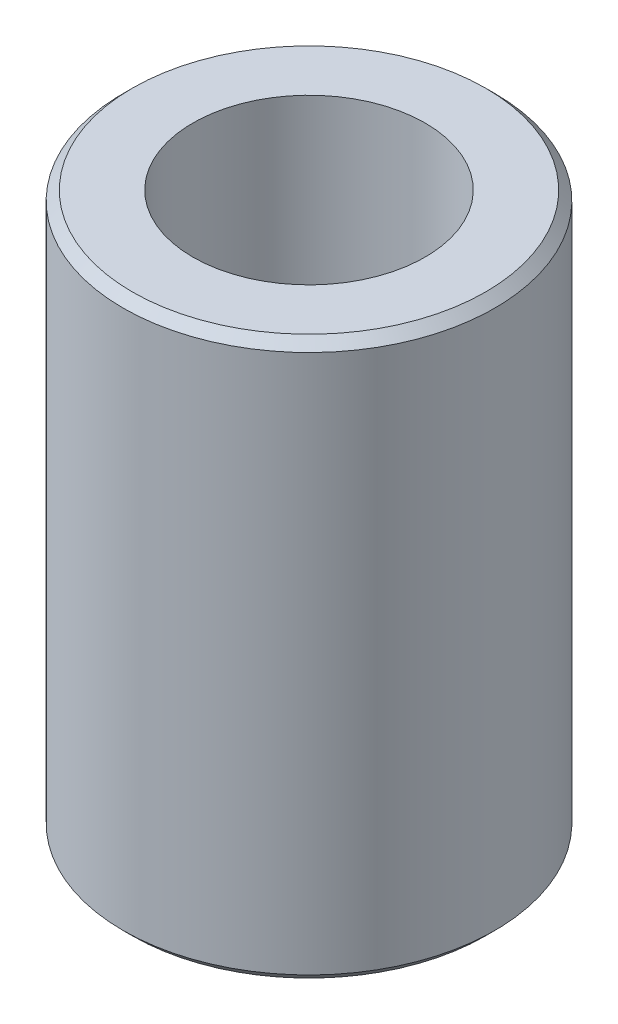
ISO-10303-21;
HEADER;
FILE_DESCRIPTION(('STEP AP214'),'2;1');
FILE_NAME('part.step','',(''),(''),'','','');
FILE_SCHEMA(('AUTOMOTIVE_DESIGN { 1 0 10303 214 1 1 1 1 }'));
ENDSEC;
DATA;
#1=APPLICATION_CONTEXT('core data for automotive mechanical design processes');
#2=APPLICATION_PROTOCOL_DEFINITION('international standard','automotive_design',2000,#1);
#3=PRODUCT_CONTEXT('',#1,'mechanical');
#4=PRODUCT('Part','Part','',(#3));
#5=PRODUCT_RELATED_PRODUCT_CATEGORY('part','',(#4));
#6=PRODUCT_DEFINITION_FORMATION('','',#4);
#7=PRODUCT_DEFINITION_CONTEXT('part definition',#1,'design');
#8=PRODUCT_DEFINITION('design','',#6,#7);
#9=PRODUCT_DEFINITION_SHAPE('','',#8);
#10=(LENGTH_UNIT() NAMED_UNIT(*) SI_UNIT(.MILLI.,.METRE.));
#11=(NAMED_UNIT(*) PLANE_ANGLE_UNIT() SI_UNIT($,.RADIAN.));
#12=(NAMED_UNIT(*) SI_UNIT($,.STERADIAN.) SOLID_ANGLE_UNIT());
#13=UNCERTAINTY_MEASURE_WITH_UNIT(LENGTH_MEASURE(1.E-05),#10,'distance_accuracy_value','');
#14=(GEOMETRIC_REPRESENTATION_CONTEXT(3) GLOBAL_UNCERTAINTY_ASSIGNED_CONTEXT((#13)) GLOBAL_UNIT_ASSIGNED_CONTEXT((#10,
#11,#12)) REPRESENTATION_CONTEXT('',''));
#15=CARTESIAN_POINT('',(0.,0.,0.));
#16=DIRECTION('',(0.,0.,1.));
#17=DIRECTION('',(1.,0.,0.));
#18=AXIS2_PLACEMENT_3D('',#15,#16,#17);
#19=CARTESIAN_POINT('',(0.,60.,0.));
#20=DIRECTION('',(0.,1.,0.));
#21=DIRECTION('',(0.,0.,1.));
#22=AXIS2_PLACEMENT_3D('',#19,#20,#21);
#23=PLANE('',#22);
#24=CARTESIAN_POINT('',(0.,60.,0.));
#25=DIRECTION('',(0.,1.,0.));
#26=DIRECTION('',(0.,0.,1.));
#27=AXIS2_PLACEMENT_3D('',#24,#25,#26);
#28=CIRCLE('',#27,19.);
#29=CARTESIAN_POINT('',(0.,60.,19.));
#30=VERTEX_POINT('',#29);
#31=EDGE_CURVE('E10',#30,#30,#28,.T.);
#32=ORIENTED_EDGE('',*,*,#31,.T.);
#33=EDGE_LOOP('',(#32));
#34=FACE_BOUND('',#33,.T.);
#35=CARTESIAN_POINT('',(0.,60.,0.));
#36=DIRECTION('',(0.,1.,0.));
#37=DIRECTION('',(0.,0.,1.));
#38=AXIS2_PLACEMENT_3D('',#35,#36,#37);
#39=CIRCLE('',#38,12.5);
#40=CARTESIAN_POINT('',(0.,60.,12.5));
#41=VERTEX_POINT('',#40);
#42=EDGE_CURVE('E58',#41,#41,#39,.T.);
#43=ORIENTED_EDGE('',*,*,#42,.F.);
#44=EDGE_LOOP('',(#43));
#45=FACE_BOUND('',#44,.T.);
#46=ADVANCED_FACE('F37',(#34,#45),#23,.T.);
#47=CARTESIAN_POINT('',(0.,0.,0.));
#48=DIRECTION('',(0.,1.,0.));
#49=DIRECTION('',(0.,0.,1.));
#50=AXIS2_PLACEMENT_3D('',#47,#48,#49);
#51=PLANE('',#50);
#52=CARTESIAN_POINT('',(0.,0.,0.));
#53=DIRECTION('',(0.,1.,0.));
#54=DIRECTION('',(0.,0.,1.));
#55=AXIS2_PLACEMENT_3D('',#52,#53,#54);
#56=CIRCLE('',#55,19.);
#57=CARTESIAN_POINT('',(0.,0.,19.));
#58=VERTEX_POINT('',#57);
#59=EDGE_CURVE('E45',#58,#58,#56,.F.);
#60=ORIENTED_EDGE('',*,*,#59,.T.);
#61=EDGE_LOOP('',(#60));
#62=FACE_BOUND('',#61,.T.);
#63=CARTESIAN_POINT('',(0.,0.,0.));
#64=DIRECTION('',(0.,1.,0.));
#65=DIRECTION('',(0.,0.,1.));
#66=AXIS2_PLACEMENT_3D('',#63,#64,#65);
#67=CIRCLE('',#66,12.5);
#68=CARTESIAN_POINT('',(0.,0.,12.5));
#69=VERTEX_POINT('',#68);
#70=EDGE_CURVE('E59',#69,#69,#67,.T.);
#71=ORIENTED_EDGE('',*,*,#70,.T.);
#72=EDGE_LOOP('',(#71));
#73=FACE_BOUND('',#72,.T.);
#74=ADVANCED_FACE('F69',(#62,#73),#51,.F.);
#75=CARTESIAN_POINT('',(0.,60.,0.));
#76=DIRECTION('',(0.,-1.,0.));
#77=DIRECTION('',(0.,0.,-1.));
#78=AXIS2_PLACEMENT_3D('',#75,#76,#77);
#79=CYLINDRICAL_SURFACE('',#78,20.);
#80=CARTESIAN_POINT('',(0.,1.,0.));
#81=DIRECTION('',(0.,1.,0.));
#82=DIRECTION('',(0.,0.,1.));
#83=AXIS2_PLACEMENT_3D('',#80,#81,#82);
#84=CIRCLE('',#83,20.);
#85=CARTESIAN_POINT('',(0.,1.,20.));
#86=VERTEX_POINT('',#85);
#87=EDGE_CURVE('E49',#86,#86,#84,.T.);
#88=ORIENTED_EDGE('',*,*,#87,.T.);
#89=EDGE_LOOP('',(#88));
#90=FACE_BOUND('',#89,.T.);
#91=CARTESIAN_POINT('',(0.,59.,0.));
#92=DIRECTION('',(0.,1.,0.));
#93=DIRECTION('',(0.,0.,1.));
#94=AXIS2_PLACEMENT_3D('',#91,#92,#93);
#95=CIRCLE('',#94,20.);
#96=CARTESIAN_POINT('',(0.,59.,20.));
#97=VERTEX_POINT('',#96);
#98=EDGE_CURVE('E53',#97,#97,#95,.F.);
#99=ORIENTED_EDGE('',*,*,#98,.T.);
#100=EDGE_LOOP('',(#99));
#101=FACE_BOUND('',#100,.T.);
#102=ADVANCED_FACE('F74',(#90,#101),#79,.T.);
#103=CARTESIAN_POINT('',(0.,60.,0.));
#104=DIRECTION('',(0.,-1.,0.));
#105=DIRECTION('',(0.,0.,-1.));
#106=AXIS2_PLACEMENT_3D('',#103,#104,#105);
#107=CYLINDRICAL_SURFACE('',#106,12.5);
#108=ORIENTED_EDGE('',*,*,#42,.T.);
#109=EDGE_LOOP('',(#108));
#110=FACE_BOUND('',#109,.T.);
#111=ORIENTED_EDGE('',*,*,#70,.F.);
#112=EDGE_LOOP('',(#111));
#113=FACE_BOUND('',#112,.T.);
#114=ADVANCED_FACE('F65',(#110,#113),#107,.F.);
#115=CARTESIAN_POINT('',(0.,1.,0.));
#116=DIRECTION('',(0.,1.,0.));
#117=DIRECTION('',(0.,0.,1.));
#118=AXIS2_PLACEMENT_3D('',#115,#116,#117);
#119=CONICAL_SURFACE('',#118,20.,0.785398163397454);
#120=ORIENTED_EDGE('',*,*,#59,.F.);
#121=EDGE_LOOP('',(#120));
#122=FACE_BOUND('',#121,.T.);
#123=ORIENTED_EDGE('',*,*,#87,.F.);
#124=EDGE_LOOP('',(#123));
#125=FACE_BOUND('',#124,.T.);
#126=ADVANCED_FACE('F81',(#122,#125),#119,.T.);
#127=CARTESIAN_POINT('',(0.,60.,0.));
#128=DIRECTION('',(0.,-1.,0.));
#129=DIRECTION('',(0.,0.,-1.));
#130=AXIS2_PLACEMENT_3D('',#127,#128,#129);
#131=CONICAL_SURFACE('',#130,19.,0.785398163397443);
#132=ORIENTED_EDGE('',*,*,#98,.F.);
#133=EDGE_LOOP('',(#132));
#134=FACE_BOUND('',#133,.T.);
#135=ORIENTED_EDGE('',*,*,#31,.F.);
#136=EDGE_LOOP('',(#135));
#137=FACE_BOUND('',#136,.T.);
#138=ADVANCED_FACE('F40',(#134,#137),#131,.T.);
#139=CLOSED_SHELL('',(#46,#74,#102,#114,#126,#138));
#140=MANIFOLD_SOLID_BREP('B2',#139);
#141=ADVANCED_BREP_SHAPE_REPRESENTATION('',(#18,#140),#14);
#142=SHAPE_DEFINITION_REPRESENTATION(#9,#141);
ENDSEC;
END-ISO-10303-21;
